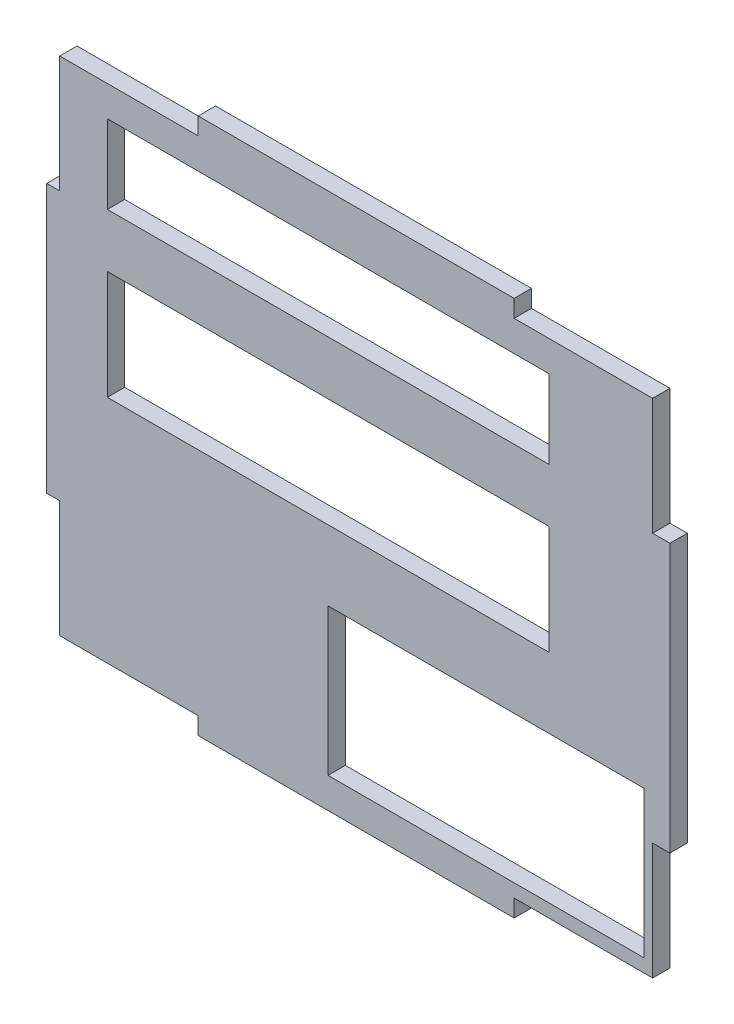
ISO-10303-21;
HEADER;
FILE_DESCRIPTION(('STEP AP214'),'2;1');
FILE_NAME('part.step','',(''),(''),'','','');
FILE_SCHEMA(('AUTOMOTIVE_DESIGN { 1 0 10303 214 1 1 1 1 }'));
ENDSEC;
DATA;
#1=APPLICATION_CONTEXT('core data for automotive mechanical design processes');
#2=APPLICATION_PROTOCOL_DEFINITION('international standard','automotive_design',2000,#1);
#3=PRODUCT_CONTEXT('',#1,'mechanical');
#4=PRODUCT('Part','Part','',(#3));
#5=PRODUCT_RELATED_PRODUCT_CATEGORY('part','',(#4));
#6=PRODUCT_DEFINITION_FORMATION('','',#4);
#7=PRODUCT_DEFINITION_CONTEXT('part definition',#1,'design');
#8=PRODUCT_DEFINITION('design','',#6,#7);
#9=PRODUCT_DEFINITION_SHAPE('','',#8);
#10=(LENGTH_UNIT() NAMED_UNIT(*) SI_UNIT(.MILLI.,.METRE.));
#11=(NAMED_UNIT(*) PLANE_ANGLE_UNIT() SI_UNIT($,.RADIAN.));
#12=(NAMED_UNIT(*) SI_UNIT($,.STERADIAN.) SOLID_ANGLE_UNIT());
#13=UNCERTAINTY_MEASURE_WITH_UNIT(LENGTH_MEASURE(1.E-05),#10,'distance_accuracy_value','');
#14=(GEOMETRIC_REPRESENTATION_CONTEXT(3) GLOBAL_UNCERTAINTY_ASSIGNED_CONTEXT((#13)) GLOBAL_UNIT_ASSIGNED_CONTEXT((#10,
#11,#12)) REPRESENTATION_CONTEXT('',''));
#15=CARTESIAN_POINT('',(0.,0.,0.));
#16=DIRECTION('',(0.,0.,1.));
#17=DIRECTION('',(1.,0.,0.));
#18=AXIS2_PLACEMENT_3D('',#15,#16,#17);
#19=CARTESIAN_POINT('',(-37.0426412226631,40.7362637362637,2.));
#20=DIRECTION('',(1.,0.,0.));
#21=DIRECTION('',(0.,0.,-1.));
#22=AXIS2_PLACEMENT_3D('',#19,#20,#21);
#23=PLANE('',#22);
#24=DIRECTION('',(0.,-1.,0.));
#25=VECTOR('',#24,1.);
#26=CARTESIAN_POINT('',(-37.0426412226631,40.7362637362637,2.));
#27=LINE('',#26,#25);
#28=CARTESIAN_POINT('',(-37.0426412226631,25.2362637362637,2.));
#29=VERTEX_POINT('',#28);
#30=CARTESIAN_POINT('',(-37.0426412226631,-5.76373626373626,2.));
#31=VERTEX_POINT('',#30);
#32=EDGE_CURVE('E463',#29,#31,#27,.T.);
#33=ORIENTED_EDGE('',*,*,#32,.F.);
#34=DIRECTION('',(0.,0.,-1.));
#35=VECTOR('',#34,1.);
#36=CARTESIAN_POINT('',(-37.0426412226631,25.2362637362637,2.));
#37=LINE('',#36,#35);
#38=CARTESIAN_POINT('',(-37.0426412226631,25.2362637362637,0.));
#39=VERTEX_POINT('',#38);
#40=EDGE_CURVE('E401',#29,#39,#37,.T.);
#41=ORIENTED_EDGE('',*,*,#40,.T.);
#42=DIRECTION('',(0.,-1.,0.));
#43=VECTOR('',#42,1.);
#44=CARTESIAN_POINT('',(-37.0426412226631,40.7362637362637,0.));
#45=LINE('',#44,#43);
#46=CARTESIAN_POINT('',(-37.0426412226631,-5.76373626373626,0.));
#47=VERTEX_POINT('',#46);
#48=EDGE_CURVE('E461',#39,#47,#45,.T.);
#49=ORIENTED_EDGE('',*,*,#48,.T.);
#50=DIRECTION('',(0.,0.,1.));
#51=VECTOR('',#50,1.);
#52=CARTESIAN_POINT('',(-37.0426412226631,-5.76373626373625,2.));
#53=LINE('',#52,#51);
#54=EDGE_CURVE('E396',#47,#31,#53,.T.);
#55=ORIENTED_EDGE('',*,*,#54,.T.);
#56=EDGE_LOOP('',(#33,#41,#49,#55));
#57=FACE_BOUND('',#56,.T.);
#58=ADVANCED_FACE('F33',(#57),#23,.F.);
#59=CARTESIAN_POINT('',(-37.0426412226631,-21.2637362637363,2.));
#60=DIRECTION('',(0.,1.,0.));
#61=DIRECTION('',(0.,0.,1.));
#62=AXIS2_PLACEMENT_3D('',#59,#60,#61);
#63=PLANE('',#62);
#64=DIRECTION('',(0.,0.,1.));
#65=VECTOR('',#64,1.);
#66=CARTESIAN_POINT('',(16.9573587773368,-21.2637362637363,0.));
#67=LINE('',#66,#65);
#68=CARTESIAN_POINT('',(16.9573587773368,-21.2637362637363,0.));
#69=VERTEX_POINT('',#68);
#70=CARTESIAN_POINT('',(16.9573587773368,-21.2637362637363,2.));
#71=VERTEX_POINT('',#70);
#72=EDGE_CURVE('E404',#69,#71,#67,.T.);
#73=ORIENTED_EDGE('',*,*,#72,.T.);
#74=DIRECTION('',(1.,0.,0.));
#75=VECTOR('',#74,1.);
#76=CARTESIAN_POINT('',(-37.0426412226631,-21.2637362637363,2.));
#77=LINE('',#76,#75);
#78=CARTESIAN_POINT('',(-19.5426412226631,-21.2637362637363,2.));
#79=VERTEX_POINT('',#78);
#80=EDGE_CURVE('E466',#79,#71,#77,.T.);
#81=ORIENTED_EDGE('',*,*,#80,.F.);
#82=DIRECTION('',(0.,0.,1.));
#83=VECTOR('',#82,1.);
#84=CARTESIAN_POINT('',(-19.5426412226631,-21.2637362637363,0.));
#85=LINE('',#84,#83);
#86=CARTESIAN_POINT('',(-19.5426412226631,-21.2637362637363,0.));
#87=VERTEX_POINT('',#86);
#88=EDGE_CURVE('E424',#87,#79,#85,.T.);
#89=ORIENTED_EDGE('',*,*,#88,.F.);
#90=DIRECTION('',(1.,0.,0.));
#91=VECTOR('',#90,1.);
#92=CARTESIAN_POINT('',(-37.0426412226631,-21.2637362637363,0.));
#93=LINE('',#92,#91);
#94=EDGE_CURVE('E479',#87,#69,#93,.T.);
#95=ORIENTED_EDGE('',*,*,#94,.T.);
#96=EDGE_LOOP('',(#73,#81,#89,#95));
#97=FACE_BOUND('',#96,.T.);
#98=ADVANCED_FACE('F541',(#97),#63,.F.);
#99=CARTESIAN_POINT('',(34.9573587773368,40.7362637362637,2.));
#100=DIRECTION('',(-1.,0.,0.));
#101=DIRECTION('',(0.,0.,1.));
#102=AXIS2_PLACEMENT_3D('',#99,#100,#101);
#103=PLANE('',#102);
#104=DIRECTION('',(0.,1.,0.));
#105=VECTOR('',#104,1.);
#106=CARTESIAN_POINT('',(34.9573587773368,40.7362637362637,2.));
#107=LINE('',#106,#105);
#108=CARTESIAN_POINT('',(34.9573587773369,-5.76373626373625,2.));
#109=VERTEX_POINT('',#108);
#110=CARTESIAN_POINT('',(34.9573587773369,25.2362637362637,2.));
#111=VERTEX_POINT('',#110);
#112=EDGE_CURVE('E470',#109,#111,#107,.T.);
#113=ORIENTED_EDGE('',*,*,#112,.F.);
#114=DIRECTION('',(0.,0.,1.));
#115=VECTOR('',#114,1.);
#116=CARTESIAN_POINT('',(34.9573587773369,-5.76373626373625,0.));
#117=LINE('',#116,#115);
#118=CARTESIAN_POINT('',(34.9573587773369,-5.76373626373625,0.));
#119=VERTEX_POINT('',#118);
#120=EDGE_CURVE('E349',#119,#109,#117,.T.);
#121=ORIENTED_EDGE('',*,*,#120,.F.);
#122=DIRECTION('',(0.,1.,0.));
#123=VECTOR('',#122,1.);
#124=CARTESIAN_POINT('',(34.9573587773368,40.7362637362637,0.));
#125=LINE('',#124,#123);
#126=CARTESIAN_POINT('',(34.9573587773369,25.2362637362637,0.));
#127=VERTEX_POINT('',#126);
#128=EDGE_CURVE('E482',#119,#127,#125,.T.);
#129=ORIENTED_EDGE('',*,*,#128,.T.);
#130=DIRECTION('',(0.,0.,1.));
#131=VECTOR('',#130,1.);
#132=CARTESIAN_POINT('',(34.9573587773369,25.2362637362637,0.));
#133=LINE('',#132,#131);
#134=EDGE_CURVE('E393',#127,#111,#133,.T.);
#135=ORIENTED_EDGE('',*,*,#134,.T.);
#136=EDGE_LOOP('',(#113,#121,#129,#135));
#137=FACE_BOUND('',#136,.T.);
#138=ADVANCED_FACE('F562',(#137),#103,.F.);
#139=CARTESIAN_POINT('',(-37.0426412226631,40.7362637362637,2.));
#140=DIRECTION('',(0.,-1.,0.));
#141=DIRECTION('',(0.,0.,-1.));
#142=AXIS2_PLACEMENT_3D('',#139,#140,#141);
#143=PLANE('',#142);
#144=DIRECTION('',(0.,0.,1.));
#145=VECTOR('',#144,1.);
#146=CARTESIAN_POINT('',(-19.5426412226631,40.7362637362637,0.));
#147=LINE('',#146,#145);
#148=CARTESIAN_POINT('',(-19.5426412226631,40.7362637362637,0.));
#149=VERTEX_POINT('',#148);
#150=CARTESIAN_POINT('',(-19.5426412226631,40.7362637362637,2.));
#151=VERTEX_POINT('',#150);
#152=EDGE_CURVE('E409',#149,#151,#147,.T.);
#153=ORIENTED_EDGE('',*,*,#152,.T.);
#154=DIRECTION('',(-1.,0.,0.));
#155=VECTOR('',#154,1.);
#156=CARTESIAN_POINT('',(-37.0426412226631,40.7362637362637,2.));
#157=LINE('',#156,#155);
#158=CARTESIAN_POINT('',(16.9573587773368,40.7362637362637,2.));
#159=VERTEX_POINT('',#158);
#160=EDGE_CURVE('E473',#159,#151,#157,.T.);
#161=ORIENTED_EDGE('',*,*,#160,.F.);
#162=DIRECTION('',(0.,0.,1.));
#163=VECTOR('',#162,1.);
#164=CARTESIAN_POINT('',(16.9573587773368,40.7362637362637,0.));
#165=LINE('',#164,#163);
#166=CARTESIAN_POINT('',(16.9573587773368,40.7362637362637,0.));
#167=VERTEX_POINT('',#166);
#168=EDGE_CURVE('E454',#167,#159,#165,.T.);
#169=ORIENTED_EDGE('',*,*,#168,.F.);
#170=DIRECTION('',(-1.,0.,0.));
#171=VECTOR('',#170,1.);
#172=CARTESIAN_POINT('',(-37.0426412226631,40.7362637362637,0.));
#173=LINE('',#172,#171);
#174=EDGE_CURVE('E467',#167,#149,#173,.T.);
#175=ORIENTED_EDGE('',*,*,#174,.T.);
#176=EDGE_LOOP('',(#153,#161,#169,#175));
#177=FACE_BOUND('',#176,.T.);
#178=ADVANCED_FACE('F512',(#177),#143,.F.);
#179=CARTESIAN_POINT('',(0.,0.,2.));
#180=DIRECTION('',(0.,0.,1.));
#181=DIRECTION('',(1.,0.,0.));
#182=AXIS2_PLACEMENT_3D('',#179,#180,#181);
#183=PLANE('',#182);
#184=DIRECTION('',(0.,1.,0.));
#185=VECTOR('',#184,1.);
#186=CARTESIAN_POINT('',(31.9573587773367,-17.7397362637363,2.));
#187=LINE('',#186,#185);
#188=CARTESIAN_POINT('',(31.9573587773367,-17.7397362637363,2.));
#189=VERTEX_POINT('',#188);
#190=CARTESIAN_POINT('',(31.9573587773367,-0.784191440651759,2.));
#191=VERTEX_POINT('',#190);
#192=EDGE_CURVE('E47',#189,#191,#187,.T.);
#193=ORIENTED_EDGE('',*,*,#192,.F.);
#194=DIRECTION('',(1.,0.,0.));
#195=VECTOR('',#194,1.);
#196=CARTESIAN_POINT('',(31.9573587773367,-17.7397362637363,2.));
#197=LINE('',#196,#195);
#198=CARTESIAN_POINT('',(-4.54264122266389,-17.7397362637363,2.));
#199=VERTEX_POINT('',#198);
#200=EDGE_CURVE('E261',#199,#189,#197,.T.);
#201=ORIENTED_EDGE('',*,*,#200,.F.);
#202=DIRECTION('',(0.,-1.,0.));
#203=VECTOR('',#202,1.);
#204=CARTESIAN_POINT('',(-4.54264122266389,-17.7397362637363,2.));
#205=LINE('',#204,#203);
#206=CARTESIAN_POINT('',(-4.54264122266389,-0.784191440651759,2.));
#207=VERTEX_POINT('',#206);
#208=EDGE_CURVE('E264',#207,#199,#205,.T.);
#209=ORIENTED_EDGE('',*,*,#208,.F.);
#210=DIRECTION('',(-1.,0.,0.));
#211=VECTOR('',#210,1.);
#212=CARTESIAN_POINT('',(31.9573587773367,-0.784191440651759,2.));
#213=LINE('',#212,#211);
#214=EDGE_CURVE('E270',#191,#207,#213,.T.);
#215=ORIENTED_EDGE('',*,*,#214,.F.);
#216=EDGE_LOOP('',(#193,#201,#209,#215));
#217=FACE_BOUND('',#216,.T.);
#218=DIRECTION('',(0.,1.,0.));
#219=VECTOR('',#218,1.);
#220=CARTESIAN_POINT('',(20.9573587773368,7.33626373626373,2.));
#221=LINE('',#220,#219);
#222=CARTESIAN_POINT('',(20.9573587773368,7.33626373626373,2.));
#223=VERTEX_POINT('',#222);
#224=CARTESIAN_POINT('',(20.9573587773368,19.9326434154229,2.));
#225=VERTEX_POINT('',#224);
#226=EDGE_CURVE('E55',#223,#225,#221,.T.);
#227=ORIENTED_EDGE('',*,*,#226,.F.);
#228=DIRECTION('',(1.,0.,0.));
#229=VECTOR('',#228,1.);
#230=CARTESIAN_POINT('',(20.9573587773368,7.33626373626373,2.));
#231=LINE('',#230,#229);
#232=CARTESIAN_POINT('',(-30.0426412226624,7.33626373626373,2.));
#233=VERTEX_POINT('',#232);
#234=EDGE_CURVE('E285',#233,#223,#231,.T.);
#235=ORIENTED_EDGE('',*,*,#234,.F.);
#236=DIRECTION('',(0.,-1.,0.));
#237=VECTOR('',#236,1.);
#238=CARTESIAN_POINT('',(-30.0426412226624,7.33626373626373,2.));
#239=LINE('',#238,#237);
#240=CARTESIAN_POINT('',(-30.0426412226624,19.9326434154229,2.));
#241=VERTEX_POINT('',#240);
#242=EDGE_CURVE('E300',#241,#233,#239,.T.);
#243=ORIENTED_EDGE('',*,*,#242,.F.);
#244=DIRECTION('',(-1.,0.,0.));
#245=VECTOR('',#244,1.);
#246=CARTESIAN_POINT('',(20.9573587773368,19.9326434154229,2.));
#247=LINE('',#246,#245);
#248=EDGE_CURVE('E296',#225,#241,#247,.T.);
#249=ORIENTED_EDGE('',*,*,#248,.F.);
#250=EDGE_LOOP('',(#227,#235,#243,#249));
#251=FACE_BOUND('',#250,.T.);
#252=DIRECTION('',(0.,1.,0.));
#253=VECTOR('',#252,1.);
#254=CARTESIAN_POINT('',(20.9573587773369,26.1362637362637,2.));
#255=LINE('',#254,#253);
#256=CARTESIAN_POINT('',(20.9573587773369,26.1362637362637,2.));
#257=VERTEX_POINT('',#256);
#258=CARTESIAN_POINT('',(20.9573587773369,35.2113091217779,2.));
#259=VERTEX_POINT('',#258);
#260=EDGE_CURVE('E325',#257,#259,#255,.T.);
#261=ORIENTED_EDGE('',*,*,#260,.F.);
#262=DIRECTION('',(1.,0.,0.));
#263=VECTOR('',#262,1.);
#264=CARTESIAN_POINT('',(20.9573587773369,26.1362637362637,2.));
#265=LINE('',#264,#263);
#266=CARTESIAN_POINT('',(-30.0426412226624,26.1362637362637,2.));
#267=VERTEX_POINT('',#266);
#268=EDGE_CURVE('E315',#267,#257,#265,.T.);
#269=ORIENTED_EDGE('',*,*,#268,.F.);
#270=DIRECTION('',(0.,-1.,0.));
#271=VECTOR('',#270,1.);
#272=CARTESIAN_POINT('',(-30.0426412226624,26.1362637362637,2.));
#273=LINE('',#272,#271);
#274=CARTESIAN_POINT('',(-30.0426412226624,35.2113091217779,2.));
#275=VERTEX_POINT('',#274);
#276=EDGE_CURVE('E330',#275,#267,#273,.T.);
#277=ORIENTED_EDGE('',*,*,#276,.F.);
#278=DIRECTION('',(-1.,0.,0.));
#279=VECTOR('',#278,1.);
#280=CARTESIAN_POINT('',(20.9573587773369,35.2113091217779,2.));
#281=LINE('',#280,#279);
#282=EDGE_CURVE('E327',#259,#275,#281,.T.);
#283=ORIENTED_EDGE('',*,*,#282,.F.);
#284=EDGE_LOOP('',(#261,#269,#277,#283));
#285=FACE_BOUND('',#284,.T.);
#286=DIRECTION('',(0.,1.,0.));
#287=VECTOR('',#286,1.);
#288=CARTESIAN_POINT('',(-35.5426412226631,40.7362637362637,2.));
#289=LINE('',#288,#287);
#290=CARTESIAN_POINT('',(-35.5426412226631,25.2362637362637,2.));
#291=VERTEX_POINT('',#290);
#292=CARTESIAN_POINT('',(-35.5426412226631,38.7362637362637,2.));
#293=VERTEX_POINT('',#292);
#294=EDGE_CURVE('E376',#291,#293,#289,.T.);
#295=ORIENTED_EDGE('',*,*,#294,.F.);
#296=DIRECTION('',(1.,0.,0.));
#297=VECTOR('',#296,1.);
#298=CARTESIAN_POINT('',(-37.5426412226631,25.2362637362637,2.));
#299=LINE('',#298,#297);
#300=EDGE_CURVE('E277',#29,#291,#299,.T.);
#301=ORIENTED_EDGE('',*,*,#300,.F.);
#302=ORIENTED_EDGE('',*,*,#32,.T.);
#303=DIRECTION('',(-1.,0.,0.));
#304=VECTOR('',#303,1.);
#305=CARTESIAN_POINT('',(-37.5426412226631,-5.76373626373626,2.));
#306=LINE('',#305,#304);
#307=CARTESIAN_POINT('',(-35.5426412226631,-5.76373626373626,2.));
#308=VERTEX_POINT('',#307);
#309=EDGE_CURVE('E363',#308,#31,#306,.T.);
#310=ORIENTED_EDGE('',*,*,#309,.F.);
#311=DIRECTION('',(0.,1.,0.));
#312=VECTOR('',#311,1.);
#313=CARTESIAN_POINT('',(-35.5426412226631,-21.2637362637363,2.));
#314=LINE('',#313,#312);
#315=CARTESIAN_POINT('',(-35.5426412226631,-19.2637362637363,2.));
#316=VERTEX_POINT('',#315);
#317=EDGE_CURVE('E366',#316,#308,#314,.T.);
#318=ORIENTED_EDGE('',*,*,#317,.F.);
#319=DIRECTION('',(1.,0.,0.));
#320=VECTOR('',#319,1.);
#321=CARTESIAN_POINT('',(-37.5426412226631,-19.2637362637363,2.));
#322=LINE('',#321,#320);
#323=CARTESIAN_POINT('',(-19.5426412226631,-19.2637362637363,2.));
#324=VERTEX_POINT('',#323);
#325=EDGE_CURVE('E412',#316,#324,#322,.T.);
#326=ORIENTED_EDGE('',*,*,#325,.T.);
#327=DIRECTION('',(0.,1.,0.));
#328=VECTOR('',#327,1.);
#329=CARTESIAN_POINT('',(-19.5426412226631,-21.2637362637363,2.));
#330=LINE('',#329,#328);
#331=EDGE_CURVE('E428',#79,#324,#330,.T.);
#332=ORIENTED_EDGE('',*,*,#331,.F.);
#333=ORIENTED_EDGE('',*,*,#80,.T.);
#334=DIRECTION('',(0.,1.,0.));
#335=VECTOR('',#334,1.);
#336=CARTESIAN_POINT('',(16.9573587773368,-21.2637362637363,2.));
#337=LINE('',#336,#335);
#338=CARTESIAN_POINT('',(16.9573587773368,-19.2637362637363,2.));
#339=VERTEX_POINT('',#338);
#340=EDGE_CURVE('E440',#71,#339,#337,.T.);
#341=ORIENTED_EDGE('',*,*,#340,.T.);
#342=DIRECTION('',(-1.,0.,0.));
#343=VECTOR('',#342,1.);
#344=CARTESIAN_POINT('',(34.9573587773368,-19.2637362637363,2.));
#345=LINE('',#344,#343);
#346=CARTESIAN_POINT('',(32.9573587773369,-19.2637362637363,2.));
#347=VERTEX_POINT('',#346);
#348=EDGE_CURVE('E425',#347,#339,#345,.T.);
#349=ORIENTED_EDGE('',*,*,#348,.F.);
#350=DIRECTION('',(0.,-1.,0.));
#351=VECTOR('',#350,1.);
#352=CARTESIAN_POINT('',(32.9573587773369,-21.2637362637363,2.));
#353=LINE('',#352,#351);
#354=CARTESIAN_POINT('',(32.9573587773369,-5.76373626373625,2.));
#355=VERTEX_POINT('',#354);
#356=EDGE_CURVE('E346',#355,#347,#353,.T.);
#357=ORIENTED_EDGE('',*,*,#356,.F.);
#358=DIRECTION('',(-1.,0.,0.));
#359=VECTOR('',#358,1.);
#360=CARTESIAN_POINT('',(34.9573587773369,-5.76373626373625,2.));
#361=LINE('',#360,#359);
#362=EDGE_CURVE('E350',#109,#355,#361,.T.);
#363=ORIENTED_EDGE('',*,*,#362,.F.);
#364=ORIENTED_EDGE('',*,*,#112,.T.);
#365=DIRECTION('',(1.,0.,0.));
#366=VECTOR('',#365,1.);
#367=CARTESIAN_POINT('',(34.9573587773369,25.2362637362637,2.));
#368=LINE('',#367,#366);
#369=CARTESIAN_POINT('',(32.9573587773369,25.2362637362637,2.));
#370=VERTEX_POINT('',#369);
#371=EDGE_CURVE('E387',#370,#111,#368,.T.);
#372=ORIENTED_EDGE('',*,*,#371,.F.);
#373=DIRECTION('',(0.,-1.,0.));
#374=VECTOR('',#373,1.);
#375=CARTESIAN_POINT('',(32.9573587773369,40.7362637362637,2.));
#376=LINE('',#375,#374);
#377=CARTESIAN_POINT('',(32.9573587773369,38.7362637362637,2.));
#378=VERTEX_POINT('',#377);
#379=EDGE_CURVE('E357',#378,#370,#376,.T.);
#380=ORIENTED_EDGE('',*,*,#379,.F.);
#381=DIRECTION('',(-1.,0.,0.));
#382=VECTOR('',#381,1.);
#383=CARTESIAN_POINT('',(34.9573587773368,38.7362637362637,2.));
#384=LINE('',#383,#382);
#385=CARTESIAN_POINT('',(16.9573587773368,38.7362637362637,2.));
#386=VERTEX_POINT('',#385);
#387=EDGE_CURVE('E452',#378,#386,#384,.T.);
#388=ORIENTED_EDGE('',*,*,#387,.T.);
#389=DIRECTION('',(0.,-1.,0.));
#390=VECTOR('',#389,1.);
#391=CARTESIAN_POINT('',(16.9573587773368,40.7362637362637,2.));
#392=LINE('',#391,#390);
#393=EDGE_CURVE('E418',#159,#386,#392,.T.);
#394=ORIENTED_EDGE('',*,*,#393,.F.);
#395=ORIENTED_EDGE('',*,*,#160,.T.);
#396=DIRECTION('',(0.,-1.,0.));
#397=VECTOR('',#396,1.);
#398=CARTESIAN_POINT('',(-19.5426412226631,40.7362637362637,2.));
#399=LINE('',#398,#397);
#400=CARTESIAN_POINT('',(-19.5426412226631,38.7362637362637,2.));
#401=VERTEX_POINT('',#400);
#402=EDGE_CURVE('E413',#151,#401,#399,.T.);
#403=ORIENTED_EDGE('',*,*,#402,.T.);
#404=DIRECTION('',(1.,0.,0.));
#405=VECTOR('',#404,1.);
#406=CARTESIAN_POINT('',(-37.5426412226631,38.7362637362637,2.));
#407=LINE('',#406,#405);
#408=EDGE_CURVE('E416',#293,#401,#407,.T.);
#409=ORIENTED_EDGE('',*,*,#408,.F.);
#410=EDGE_LOOP('',(#295,#301,#302,#310,#318,#326,#332,#333,#341,#349,#357,#363,#364,#372,#380,
#388,#394,#395,#403,#409));
#411=FACE_BOUND('',#410,.T.);
#412=ADVANCED_FACE('F504',(#217,#251,#285,#411),#183,.T.);
#413=CARTESIAN_POINT('',(0.,0.,0.));
#414=DIRECTION('',(0.,0.,1.));
#415=DIRECTION('',(1.,0.,0.));
#416=AXIS2_PLACEMENT_3D('',#413,#414,#415);
#417=PLANE('',#416);
#418=DIRECTION('',(1.,0.,0.));
#419=VECTOR('',#418,1.);
#420=CARTESIAN_POINT('',(31.9573587773367,-17.7397362637363,0.));
#421=LINE('',#420,#419);
#422=CARTESIAN_POINT('',(-4.54264122266389,-17.7397362637363,0.));
#423=VERTEX_POINT('',#422);
#424=CARTESIAN_POINT('',(31.9573587773367,-17.7397362637363,0.));
#425=VERTEX_POINT('',#424);
#426=EDGE_CURVE('E248',#423,#425,#421,.T.);
#427=ORIENTED_EDGE('',*,*,#426,.T.);
#428=DIRECTION('',(0.,1.,0.));
#429=VECTOR('',#428,1.);
#430=CARTESIAN_POINT('',(31.9573587773367,-17.7397362637363,0.));
#431=LINE('',#430,#429);
#432=CARTESIAN_POINT('',(31.9573587773367,-0.784191440651759,0.));
#433=VERTEX_POINT('',#432);
#434=EDGE_CURVE('E242',#425,#433,#431,.T.);
#435=ORIENTED_EDGE('',*,*,#434,.T.);
#436=DIRECTION('',(-1.,0.,0.));
#437=VECTOR('',#436,1.);
#438=CARTESIAN_POINT('',(31.9573587773367,-0.784191440651759,0.));
#439=LINE('',#438,#437);
#440=CARTESIAN_POINT('',(-4.54264122266389,-0.784191440651759,0.));
#441=VERTEX_POINT('',#440);
#442=EDGE_CURVE('E252',#433,#441,#439,.T.);
#443=ORIENTED_EDGE('',*,*,#442,.T.);
#444=DIRECTION('',(0.,-1.,0.));
#445=VECTOR('',#444,1.);
#446=CARTESIAN_POINT('',(-4.54264122266389,-17.7397362637363,0.));
#447=LINE('',#446,#445);
#448=EDGE_CURVE('E256',#441,#423,#447,.T.);
#449=ORIENTED_EDGE('',*,*,#448,.T.);
#450=EDGE_LOOP('',(#427,#435,#443,#449));
#451=FACE_BOUND('',#450,.T.);
#452=DIRECTION('',(1.,0.,0.));
#453=VECTOR('',#452,1.);
#454=CARTESIAN_POINT('',(20.9573587773368,7.33626373626373,0.));
#455=LINE('',#454,#453);
#456=CARTESIAN_POINT('',(-30.0426412226624,7.33626373626373,0.));
#457=VERTEX_POINT('',#456);
#458=CARTESIAN_POINT('',(20.9573587773368,7.33626373626373,0.));
#459=VERTEX_POINT('',#458);
#460=EDGE_CURVE('E291',#457,#459,#455,.T.);
#461=ORIENTED_EDGE('',*,*,#460,.T.);
#462=DIRECTION('',(0.,1.,0.));
#463=VECTOR('',#462,1.);
#464=CARTESIAN_POINT('',(20.9573587773368,7.33626373626373,0.));
#465=LINE('',#464,#463);
#466=CARTESIAN_POINT('',(20.9573587773368,19.9326434154229,0.));
#467=VERTEX_POINT('',#466);
#468=EDGE_CURVE('E281',#459,#467,#465,.T.);
#469=ORIENTED_EDGE('',*,*,#468,.T.);
#470=DIRECTION('',(-1.,0.,0.));
#471=VECTOR('',#470,1.);
#472=CARTESIAN_POINT('',(20.9573587773368,19.9326434154229,0.));
#473=LINE('',#472,#471);
#474=CARTESIAN_POINT('',(-30.0426412226624,19.9326434154229,0.));
#475=VERTEX_POINT('',#474);
#476=EDGE_CURVE('E284',#467,#475,#473,.T.);
#477=ORIENTED_EDGE('',*,*,#476,.T.);
#478=DIRECTION('',(0.,-1.,0.));
#479=VECTOR('',#478,1.);
#480=CARTESIAN_POINT('',(-30.0426412226624,7.33626373626373,0.));
#481=LINE('',#480,#479);
#482=EDGE_CURVE('E288',#475,#457,#481,.T.);
#483=ORIENTED_EDGE('',*,*,#482,.T.);
#484=EDGE_LOOP('',(#461,#469,#477,#483));
#485=FACE_BOUND('',#484,.T.);
#486=DIRECTION('',(1.,0.,0.));
#487=VECTOR('',#486,1.);
#488=CARTESIAN_POINT('',(20.9573587773369,26.1362637362637,0.));
#489=LINE('',#488,#487);
#490=CARTESIAN_POINT('',(-30.0426412226624,26.1362637362637,0.));
#491=VERTEX_POINT('',#490);
#492=CARTESIAN_POINT('',(20.9573587773369,26.1362637362637,0.));
#493=VERTEX_POINT('',#492);
#494=EDGE_CURVE('E321',#491,#493,#489,.T.);
#495=ORIENTED_EDGE('',*,*,#494,.T.);
#496=DIRECTION('',(0.,1.,0.));
#497=VECTOR('',#496,1.);
#498=CARTESIAN_POINT('',(20.9573587773369,26.1362637362637,0.));
#499=LINE('',#498,#497);
#500=CARTESIAN_POINT('',(20.9573587773369,35.2113091217779,0.));
#501=VERTEX_POINT('',#500);
#502=EDGE_CURVE('E311',#493,#501,#499,.T.);
#503=ORIENTED_EDGE('',*,*,#502,.T.);
#504=DIRECTION('',(-1.,0.,0.));
#505=VECTOR('',#504,1.);
#506=CARTESIAN_POINT('',(20.9573587773369,35.2113091217779,0.));
#507=LINE('',#506,#505);
#508=CARTESIAN_POINT('',(-30.0426412226624,35.2113091217779,0.));
#509=VERTEX_POINT('',#508);
#510=EDGE_CURVE('E314',#501,#509,#507,.T.);
#511=ORIENTED_EDGE('',*,*,#510,.T.);
#512=DIRECTION('',(0.,-1.,0.));
#513=VECTOR('',#512,1.);
#514=CARTESIAN_POINT('',(-30.0426412226624,26.1362637362637,0.));
#515=LINE('',#514,#513);
#516=EDGE_CURVE('E318',#509,#491,#515,.T.);
#517=ORIENTED_EDGE('',*,*,#516,.T.);
#518=EDGE_LOOP('',(#495,#503,#511,#517));
#519=FACE_BOUND('',#518,.T.);
#520=DIRECTION('',(1.,0.,0.));
#521=VECTOR('',#520,1.);
#522=CARTESIAN_POINT('',(-37.5426412226631,25.2362637362637,0.));
#523=LINE('',#522,#521);
#524=CARTESIAN_POINT('',(-35.5426412226631,25.2362637362637,0.));
#525=VERTEX_POINT('',#524);
#526=EDGE_CURVE('E372',#39,#525,#523,.T.);
#527=ORIENTED_EDGE('',*,*,#526,.T.);
#528=DIRECTION('',(0.,1.,0.));
#529=VECTOR('',#528,1.);
#530=CARTESIAN_POINT('',(-35.5426412226631,40.7362637362637,0.));
#531=LINE('',#530,#529);
#532=CARTESIAN_POINT('',(-35.5426412226631,38.7362637362637,0.));
#533=VERTEX_POINT('',#532);
#534=EDGE_CURVE('E375',#525,#533,#531,.T.);
#535=ORIENTED_EDGE('',*,*,#534,.T.);
#536=DIRECTION('',(1.,0.,0.));
#537=VECTOR('',#536,1.);
#538=CARTESIAN_POINT('',(0.,38.7362637362637,0.));
#539=LINE('',#538,#537);
#540=CARTESIAN_POINT('',(-19.5426412226631,38.7362637362637,0.));
#541=VERTEX_POINT('',#540);
#542=EDGE_CURVE('E476',#533,#541,#539,.T.);
#543=ORIENTED_EDGE('',*,*,#542,.T.);
#544=DIRECTION('',(0.,-1.,0.));
#545=VECTOR('',#544,1.);
#546=CARTESIAN_POINT('',(-19.5426412226631,40.7362637362637,0.));
#547=LINE('',#546,#545);
#548=EDGE_CURVE('E408',#149,#541,#547,.T.);
#549=ORIENTED_EDGE('',*,*,#548,.F.);
#550=ORIENTED_EDGE('',*,*,#174,.F.);
#551=DIRECTION('',(0.,-1.,0.));
#552=VECTOR('',#551,1.);
#553=CARTESIAN_POINT('',(16.9573587773368,40.7362637362637,0.));
#554=LINE('',#553,#552);
#555=CARTESIAN_POINT('',(16.9573587773368,38.7362637362637,0.));
#556=VERTEX_POINT('',#555);
#557=EDGE_CURVE('E448',#167,#556,#554,.T.);
#558=ORIENTED_EDGE('',*,*,#557,.T.);
#559=DIRECTION('',(-1.,0.,0.));
#560=VECTOR('',#559,1.);
#561=CARTESIAN_POINT('',(34.9573587773368,38.7362637362637,0.));
#562=LINE('',#561,#560);
#563=CARTESIAN_POINT('',(32.9573587773369,38.7362637362637,0.));
#564=VERTEX_POINT('',#563);
#565=EDGE_CURVE('E451',#564,#556,#562,.T.);
#566=ORIENTED_EDGE('',*,*,#565,.F.);
#567=DIRECTION('',(0.,-1.,0.));
#568=VECTOR('',#567,1.);
#569=CARTESIAN_POINT('',(32.9573587773369,40.7362637362637,0.));
#570=LINE('',#569,#568);
#571=CARTESIAN_POINT('',(32.9573587773369,25.2362637362637,0.));
#572=VERTEX_POINT('',#571);
#573=EDGE_CURVE('E383',#564,#572,#570,.T.);
#574=ORIENTED_EDGE('',*,*,#573,.T.);
#575=DIRECTION('',(1.,0.,0.));
#576=VECTOR('',#575,1.);
#577=CARTESIAN_POINT('',(34.9573587773369,25.2362637362637,0.));
#578=LINE('',#577,#576);
#579=EDGE_CURVE('E386',#572,#127,#578,.T.);
#580=ORIENTED_EDGE('',*,*,#579,.T.);
#581=ORIENTED_EDGE('',*,*,#128,.F.);
#582=DIRECTION('',(-1.,0.,0.));
#583=VECTOR('',#582,1.);
#584=CARTESIAN_POINT('',(34.9573587773369,-5.76373626373625,0.));
#585=LINE('',#584,#583);
#586=CARTESIAN_POINT('',(32.9573587773369,-5.76373626373625,0.));
#587=VERTEX_POINT('',#586);
#588=EDGE_CURVE('E342',#119,#587,#585,.T.);
#589=ORIENTED_EDGE('',*,*,#588,.T.);
#590=DIRECTION('',(0.,-1.,0.));
#591=VECTOR('',#590,1.);
#592=CARTESIAN_POINT('',(32.9573587773369,-21.2637362637363,0.));
#593=LINE('',#592,#591);
#594=CARTESIAN_POINT('',(32.9573587773369,-19.2637362637363,0.));
#595=VERTEX_POINT('',#594);
#596=EDGE_CURVE('E345',#587,#595,#593,.T.);
#597=ORIENTED_EDGE('',*,*,#596,.T.);
#598=DIRECTION('',(-1.,0.,0.));
#599=VECTOR('',#598,1.);
#600=CARTESIAN_POINT('',(34.9573587773368,-19.2637362637363,0.));
#601=LINE('',#600,#599);
#602=CARTESIAN_POINT('',(16.9573587773368,-19.2637362637363,0.));
#603=VERTEX_POINT('',#602);
#604=EDGE_CURVE('E443',#595,#603,#601,.T.);
#605=ORIENTED_EDGE('',*,*,#604,.T.);
#606=DIRECTION('',(0.,1.,0.));
#607=VECTOR('',#606,1.);
#608=CARTESIAN_POINT('',(16.9573587773368,-21.2637362637363,0.));
#609=LINE('',#608,#607);
#610=EDGE_CURVE('E437',#69,#603,#609,.T.);
#611=ORIENTED_EDGE('',*,*,#610,.F.);
#612=ORIENTED_EDGE('',*,*,#94,.F.);
#613=DIRECTION('',(0.,1.,0.));
#614=VECTOR('',#613,1.);
#615=CARTESIAN_POINT('',(-19.5426412226631,-21.2637362637363,0.));
#616=LINE('',#615,#614);
#617=CARTESIAN_POINT('',(-19.5426412226631,-19.2637362637363,0.));
#618=VERTEX_POINT('',#617);
#619=EDGE_CURVE('E427',#87,#618,#616,.T.);
#620=ORIENTED_EDGE('',*,*,#619,.T.);
#621=DIRECTION('',(1.,0.,0.));
#622=VECTOR('',#621,1.);
#623=CARTESIAN_POINT('',(0.,-19.2637362637363,0.));
#624=LINE('',#623,#622);
#625=CARTESIAN_POINT('',(-35.5426412226631,-19.2637362637363,0.));
#626=VERTEX_POINT('',#625);
#627=EDGE_CURVE('E488',#626,#618,#624,.T.);
#628=ORIENTED_EDGE('',*,*,#627,.F.);
#629=DIRECTION('',(0.,1.,0.));
#630=VECTOR('',#629,1.);
#631=CARTESIAN_POINT('',(-35.5426412226631,-21.2637362637363,0.));
#632=LINE('',#631,#630);
#633=CARTESIAN_POINT('',(-35.5426412226631,-5.76373626373626,0.));
#634=VERTEX_POINT('',#633);
#635=EDGE_CURVE('E359',#626,#634,#632,.T.);
#636=ORIENTED_EDGE('',*,*,#635,.T.);
#637=DIRECTION('',(-1.,0.,0.));
#638=VECTOR('',#637,1.);
#639=CARTESIAN_POINT('',(-37.5426412226631,-5.76373626373626,0.));
#640=LINE('',#639,#638);
#641=EDGE_CURVE('E362',#634,#47,#640,.T.);
#642=ORIENTED_EDGE('',*,*,#641,.T.);
#643=ORIENTED_EDGE('',*,*,#48,.F.);
#644=EDGE_LOOP('',(#527,#535,#543,#549,#550,#558,#566,#574,#580,#581,#589,#597,#605,#611,#612,
#620,#628,#636,#642,#643));
#645=FACE_BOUND('',#644,.T.);
#646=ADVANCED_FACE('F258',(#451,#485,#519,#645),#417,.F.);
#647=CARTESIAN_POINT('',(34.9573587773368,38.7362637362637,0.));
#648=DIRECTION('',(0.,1.,0.));
#649=DIRECTION('',(0.,0.,1.));
#650=AXIS2_PLACEMENT_3D('',#647,#648,#649);
#651=PLANE('',#650);
#652=DIRECTION('',(0.,0.,1.));
#653=VECTOR('',#652,1.);
#654=CARTESIAN_POINT('',(32.9573587773369,38.7362637362637,0.));
#655=LINE('',#654,#653);
#656=EDGE_CURVE('E11',#564,#378,#655,.T.);
#657=ORIENTED_EDGE('',*,*,#656,.F.);
#658=ORIENTED_EDGE('',*,*,#565,.T.);
#659=DIRECTION('',(0.,0.,1.));
#660=VECTOR('',#659,1.);
#661=CARTESIAN_POINT('',(16.9573587773368,38.7362637362637,0.));
#662=LINE('',#661,#660);
#663=EDGE_CURVE('E458',#556,#386,#662,.T.);
#664=ORIENTED_EDGE('',*,*,#663,.T.);
#665=ORIENTED_EDGE('',*,*,#387,.F.);
#666=EDGE_LOOP('',(#657,#658,#664,#665));
#667=FACE_BOUND('',#666,.T.);
#668=ADVANCED_FACE('F572',(#667),#651,.T.);
#669=CARTESIAN_POINT('',(16.9573587773368,40.7362637362637,0.));
#670=DIRECTION('',(-1.,0.,0.));
#671=DIRECTION('',(0.,0.,1.));
#672=AXIS2_PLACEMENT_3D('',#669,#670,#671);
#673=PLANE('',#672);
#674=ORIENTED_EDGE('',*,*,#393,.T.);
#675=ORIENTED_EDGE('',*,*,#663,.F.);
#676=ORIENTED_EDGE('',*,*,#557,.F.);
#677=ORIENTED_EDGE('',*,*,#168,.T.);
#678=EDGE_LOOP('',(#674,#675,#676,#677));
#679=FACE_BOUND('',#678,.T.);
#680=ADVANCED_FACE('F575',(#679),#673,.F.);
#681=CARTESIAN_POINT('',(-37.5426412226631,38.7362637362637,0.));
#682=DIRECTION('',(0.,-1.,0.));
#683=DIRECTION('',(0.,0.,-1.));
#684=AXIS2_PLACEMENT_3D('',#681,#682,#683);
#685=PLANE('',#684);
#686=ORIENTED_EDGE('',*,*,#542,.F.);
#687=DIRECTION('',(0.,0.,1.));
#688=VECTOR('',#687,1.);
#689=CARTESIAN_POINT('',(-35.5426412226631,38.7362637362637,0.));
#690=LINE('',#689,#688);
#691=EDGE_CURVE('E40',#533,#293,#690,.T.);
#692=ORIENTED_EDGE('',*,*,#691,.T.);
#693=ORIENTED_EDGE('',*,*,#408,.T.);
#694=DIRECTION('',(0.,0.,1.));
#695=VECTOR('',#694,1.);
#696=CARTESIAN_POINT('',(-19.5426412226631,38.7362637362637,0.));
#697=LINE('',#696,#695);
#698=EDGE_CURVE('E405',#541,#401,#697,.T.);
#699=ORIENTED_EDGE('',*,*,#698,.F.);
#700=EDGE_LOOP('',(#686,#692,#693,#699));
#701=FACE_BOUND('',#700,.T.);
#702=ADVANCED_FACE('F498',(#701),#685,.F.);
#703=CARTESIAN_POINT('',(-19.5426412226631,40.7362637362637,0.));
#704=DIRECTION('',(-1.,0.,0.));
#705=DIRECTION('',(0.,0.,1.));
#706=AXIS2_PLACEMENT_3D('',#703,#704,#705);
#707=PLANE('',#706);
#708=ORIENTED_EDGE('',*,*,#402,.F.);
#709=ORIENTED_EDGE('',*,*,#152,.F.);
#710=ORIENTED_EDGE('',*,*,#548,.T.);
#711=ORIENTED_EDGE('',*,*,#698,.T.);
#712=EDGE_LOOP('',(#708,#709,#710,#711));
#713=FACE_BOUND('',#712,.T.);
#714=ADVANCED_FACE('F509',(#713),#707,.T.);
#715=CARTESIAN_POINT('',(-37.5426412226631,-19.2637362637363,0.));
#716=DIRECTION('',(0.,-1.,0.));
#717=DIRECTION('',(0.,0.,-1.));
#718=AXIS2_PLACEMENT_3D('',#715,#716,#717);
#719=PLANE('',#718);
#720=DIRECTION('',(0.,0.,1.));
#721=VECTOR('',#720,1.);
#722=CARTESIAN_POINT('',(-35.5426412226631,-19.2637362637363,0.));
#723=LINE('',#722,#721);
#724=EDGE_CURVE('E493',#626,#316,#723,.T.);
#725=ORIENTED_EDGE('',*,*,#724,.F.);
#726=ORIENTED_EDGE('',*,*,#627,.T.);
#727=DIRECTION('',(0.,0.,1.));
#728=VECTOR('',#727,1.);
#729=CARTESIAN_POINT('',(-19.5426412226631,-19.2637362637363,0.));
#730=LINE('',#729,#728);
#731=EDGE_CURVE('E421',#618,#324,#730,.T.);
#732=ORIENTED_EDGE('',*,*,#731,.T.);
#733=ORIENTED_EDGE('',*,*,#325,.F.);
#734=EDGE_LOOP('',(#725,#726,#732,#733));
#735=FACE_BOUND('',#734,.T.);
#736=ADVANCED_FACE('F534',(#735),#719,.T.);
#737=CARTESIAN_POINT('',(-19.5426412226631,-21.2637362637363,0.));
#738=DIRECTION('',(1.,0.,0.));
#739=DIRECTION('',(0.,0.,-1.));
#740=AXIS2_PLACEMENT_3D('',#737,#738,#739);
#741=PLANE('',#740);
#742=ORIENTED_EDGE('',*,*,#331,.T.);
#743=ORIENTED_EDGE('',*,*,#731,.F.);
#744=ORIENTED_EDGE('',*,*,#619,.F.);
#745=ORIENTED_EDGE('',*,*,#88,.T.);
#746=EDGE_LOOP('',(#742,#743,#744,#745));
#747=FACE_BOUND('',#746,.T.);
#748=ADVANCED_FACE('F659',(#747),#741,.F.);
#749=CARTESIAN_POINT('',(16.9573587773368,-21.2637362637363,0.));
#750=DIRECTION('',(1.,0.,0.));
#751=DIRECTION('',(0.,0.,-1.));
#752=AXIS2_PLACEMENT_3D('',#749,#750,#751);
#753=PLANE('',#752);
#754=ORIENTED_EDGE('',*,*,#340,.F.);
#755=ORIENTED_EDGE('',*,*,#72,.F.);
#756=ORIENTED_EDGE('',*,*,#610,.T.);
#757=DIRECTION('',(0.,0.,1.));
#758=VECTOR('',#757,1.);
#759=CARTESIAN_POINT('',(16.9573587773368,-19.2637362637363,0.));
#760=LINE('',#759,#758);
#761=EDGE_CURVE('E434',#603,#339,#760,.T.);
#762=ORIENTED_EDGE('',*,*,#761,.T.);
#763=EDGE_LOOP('',(#754,#755,#756,#762));
#764=FACE_BOUND('',#763,.T.);
#765=ADVANCED_FACE('F545',(#764),#753,.T.);
#766=CARTESIAN_POINT('',(34.9573587773368,-19.2637362637363,0.));
#767=DIRECTION('',(0.,1.,0.));
#768=DIRECTION('',(-1.,0.,0.));
#769=AXIS2_PLACEMENT_3D('',#766,#767,#768);
#770=PLANE('',#769);
#771=ORIENTED_EDGE('',*,*,#604,.F.);
#772=DIRECTION('',(0.,0.,1.));
#773=VECTOR('',#772,1.);
#774=CARTESIAN_POINT('',(32.9573587773369,-19.2637362637363,0.));
#775=LINE('',#774,#773);
#776=EDGE_CURVE('E490',#595,#347,#775,.T.);
#777=ORIENTED_EDGE('',*,*,#776,.T.);
#778=ORIENTED_EDGE('',*,*,#348,.T.);
#779=ORIENTED_EDGE('',*,*,#761,.F.);
#780=EDGE_LOOP('',(#771,#777,#778,#779));
#781=FACE_BOUND('',#780,.T.);
#782=ADVANCED_FACE('F550',(#781),#770,.F.);
#783=CARTESIAN_POINT('',(32.9573587773369,-21.2637362637363,0.));
#784=DIRECTION('',(-1.,0.,0.));
#785=DIRECTION('',(0.,0.,1.));
#786=AXIS2_PLACEMENT_3D('',#783,#784,#785);
#787=PLANE('',#786);
#788=ORIENTED_EDGE('',*,*,#596,.F.);
#789=DIRECTION('',(0.,0.,1.));
#790=VECTOR('',#789,1.);
#791=CARTESIAN_POINT('',(32.9573587773369,-5.76373626373625,0.));
#792=LINE('',#791,#790);
#793=EDGE_CURVE('E355',#587,#355,#792,.T.);
#794=ORIENTED_EDGE('',*,*,#793,.T.);
#795=ORIENTED_EDGE('',*,*,#356,.T.);
#796=ORIENTED_EDGE('',*,*,#776,.F.);
#797=EDGE_LOOP('',(#788,#794,#795,#796));
#798=FACE_BOUND('',#797,.T.);
#799=ADVANCED_FACE('F556',(#798),#787,.F.);
#800=CARTESIAN_POINT('',(34.9573587773369,-5.76373626373625,0.));
#801=DIRECTION('',(0.,1.,0.));
#802=DIRECTION('',(0.,0.,1.));
#803=AXIS2_PLACEMENT_3D('',#800,#801,#802);
#804=PLANE('',#803);
#805=ORIENTED_EDGE('',*,*,#362,.T.);
#806=ORIENTED_EDGE('',*,*,#793,.F.);
#807=ORIENTED_EDGE('',*,*,#588,.F.);
#808=ORIENTED_EDGE('',*,*,#120,.T.);
#809=EDGE_LOOP('',(#805,#806,#807,#808));
#810=FACE_BOUND('',#809,.T.);
#811=ADVANCED_FACE('F558',(#810),#804,.F.);
#812=CARTESIAN_POINT('',(-37.5426412226631,-5.76373626373626,0.));
#813=DIRECTION('',(0.,1.,0.));
#814=DIRECTION('',(0.,0.,1.));
#815=AXIS2_PLACEMENT_3D('',#812,#813,#814);
#816=PLANE('',#815);
#817=ORIENTED_EDGE('',*,*,#641,.F.);
#818=DIRECTION('',(0.,0.,1.));
#819=VECTOR('',#818,1.);
#820=CARTESIAN_POINT('',(-35.5426412226631,-5.76373626373626,0.));
#821=LINE('',#820,#819);
#822=EDGE_CURVE('E353',#634,#308,#821,.T.);
#823=ORIENTED_EDGE('',*,*,#822,.T.);
#824=ORIENTED_EDGE('',*,*,#309,.T.);
#825=ORIENTED_EDGE('',*,*,#54,.F.);
#826=EDGE_LOOP('',(#817,#823,#824,#825));
#827=FACE_BOUND('',#826,.T.);
#828=ADVANCED_FACE('F526',(#827),#816,.F.);
#829=CARTESIAN_POINT('',(-35.5426412226631,-21.2637362637363,0.));
#830=DIRECTION('',(1.,0.,0.));
#831=DIRECTION('',(0.,0.,-1.));
#832=AXIS2_PLACEMENT_3D('',#829,#830,#831);
#833=PLANE('',#832);
#834=ORIENTED_EDGE('',*,*,#724,.T.);
#835=ORIENTED_EDGE('',*,*,#317,.T.);
#836=ORIENTED_EDGE('',*,*,#822,.F.);
#837=ORIENTED_EDGE('',*,*,#635,.F.);
#838=EDGE_LOOP('',(#834,#835,#836,#837));
#839=FACE_BOUND('',#838,.T.);
#840=ADVANCED_FACE('F530',(#839),#833,.F.);
#841=CARTESIAN_POINT('',(-37.5426412226631,25.2362637362637,0.));
#842=DIRECTION('',(0.,-1.,0.));
#843=DIRECTION('',(1.,0.,0.));
#844=AXIS2_PLACEMENT_3D('',#841,#842,#843);
#845=PLANE('',#844);
#846=ORIENTED_EDGE('',*,*,#300,.T.);
#847=DIRECTION('',(0.,0.,1.));
#848=VECTOR('',#847,1.);
#849=CARTESIAN_POINT('',(-35.5426412226631,25.2362637362637,0.));
#850=LINE('',#849,#848);
#851=EDGE_CURVE('E368',#525,#291,#850,.T.);
#852=ORIENTED_EDGE('',*,*,#851,.F.);
#853=ORIENTED_EDGE('',*,*,#526,.F.);
#854=ORIENTED_EDGE('',*,*,#40,.F.);
#855=EDGE_LOOP('',(#846,#852,#853,#854));
#856=FACE_BOUND('',#855,.T.);
#857=ADVANCED_FACE('F520',(#856),#845,.F.);
#858=CARTESIAN_POINT('',(-35.5426412226631,40.7362637362637,0.));
#859=DIRECTION('',(1.,0.,0.));
#860=DIRECTION('',(0.,0.,-1.));
#861=AXIS2_PLACEMENT_3D('',#858,#859,#860);
#862=PLANE('',#861);
#863=ORIENTED_EDGE('',*,*,#534,.F.);
#864=ORIENTED_EDGE('',*,*,#851,.T.);
#865=ORIENTED_EDGE('',*,*,#294,.T.);
#866=ORIENTED_EDGE('',*,*,#691,.F.);
#867=EDGE_LOOP('',(#863,#864,#865,#866));
#868=FACE_BOUND('',#867,.T.);
#869=ADVANCED_FACE('F518',(#868),#862,.F.);
#870=CARTESIAN_POINT('',(34.9573587773369,25.2362637362637,0.));
#871=DIRECTION('',(0.,-1.,0.));
#872=DIRECTION('',(0.,0.,-1.));
#873=AXIS2_PLACEMENT_3D('',#870,#871,#872);
#874=PLANE('',#873);
#875=ORIENTED_EDGE('',*,*,#371,.T.);
#876=ORIENTED_EDGE('',*,*,#134,.F.);
#877=ORIENTED_EDGE('',*,*,#579,.F.);
#878=DIRECTION('',(0.,0.,1.));
#879=VECTOR('',#878,1.);
#880=CARTESIAN_POINT('',(32.9573587773369,25.2362637362637,0.));
#881=LINE('',#880,#879);
#882=EDGE_CURVE('E390',#572,#370,#881,.T.);
#883=ORIENTED_EDGE('',*,*,#882,.T.);
#884=EDGE_LOOP('',(#875,#876,#877,#883));
#885=FACE_BOUND('',#884,.T.);
#886=ADVANCED_FACE('F565',(#885),#874,.F.);
#887=CARTESIAN_POINT('',(32.9573587773369,40.7362637362637,0.));
#888=DIRECTION('',(-1.,0.,0.));
#889=DIRECTION('',(0.,0.,1.));
#890=AXIS2_PLACEMENT_3D('',#887,#888,#889);
#891=PLANE('',#890);
#892=ORIENTED_EDGE('',*,*,#656,.T.);
#893=ORIENTED_EDGE('',*,*,#379,.T.);
#894=ORIENTED_EDGE('',*,*,#882,.F.);
#895=ORIENTED_EDGE('',*,*,#573,.F.);
#896=EDGE_LOOP('',(#892,#893,#894,#895));
#897=FACE_BOUND('',#896,.T.);
#898=ADVANCED_FACE('F638',(#897),#891,.F.);
#899=CARTESIAN_POINT('',(20.9573587773369,26.1362637362637,0.));
#900=DIRECTION('',(1.,0.,0.));
#901=DIRECTION('',(0.,0.,-1.));
#902=AXIS2_PLACEMENT_3D('',#899,#900,#901);
#903=PLANE('',#902);
#904=ORIENTED_EDGE('',*,*,#260,.T.);
#905=DIRECTION('',(0.,0.,1.));
#906=VECTOR('',#905,1.);
#907=CARTESIAN_POINT('',(20.9573587773369,35.2113091217779,0.));
#908=LINE('',#907,#906);
#909=EDGE_CURVE('E324',#501,#259,#908,.T.);
#910=ORIENTED_EDGE('',*,*,#909,.F.);
#911=ORIENTED_EDGE('',*,*,#502,.F.);
#912=DIRECTION('',(0.,0.,1.));
#913=VECTOR('',#912,1.);
#914=CARTESIAN_POINT('',(20.9573587773369,26.1362637362637,0.));
#915=LINE('',#914,#913);
#916=EDGE_CURVE('E297',#493,#257,#915,.T.);
#917=ORIENTED_EDGE('',*,*,#916,.T.);
#918=EDGE_LOOP('',(#904,#910,#911,#917));
#919=FACE_BOUND('',#918,.T.);
#920=ADVANCED_FACE('F613',(#919),#903,.F.);
#921=CARTESIAN_POINT('',(20.9573587773369,26.1362637362637,0.));
#922=DIRECTION('',(0.,-1.,0.));
#923=DIRECTION('',(0.,0.,-1.));
#924=AXIS2_PLACEMENT_3D('',#921,#922,#923);
#925=PLANE('',#924);
#926=ORIENTED_EDGE('',*,*,#268,.T.);
#927=ORIENTED_EDGE('',*,*,#916,.F.);
#928=ORIENTED_EDGE('',*,*,#494,.F.);
#929=DIRECTION('',(0.,0.,1.));
#930=VECTOR('',#929,1.);
#931=CARTESIAN_POINT('',(-30.0426412226624,26.1362637362637,0.));
#932=LINE('',#931,#930);
#933=EDGE_CURVE('E336',#491,#267,#932,.T.);
#934=ORIENTED_EDGE('',*,*,#933,.T.);
#935=EDGE_LOOP('',(#926,#927,#928,#934));
#936=FACE_BOUND('',#935,.T.);
#937=ADVANCED_FACE('F622',(#936),#925,.F.);
#938=CARTESIAN_POINT('',(-30.0426412226624,26.1362637362637,0.));
#939=DIRECTION('',(-1.,0.,0.));
#940=DIRECTION('',(0.,0.,1.));
#941=AXIS2_PLACEMENT_3D('',#938,#939,#940);
#942=PLANE('',#941);
#943=ORIENTED_EDGE('',*,*,#276,.T.);
#944=ORIENTED_EDGE('',*,*,#933,.F.);
#945=ORIENTED_EDGE('',*,*,#516,.F.);
#946=DIRECTION('',(0.,0.,1.));
#947=VECTOR('',#946,1.);
#948=CARTESIAN_POINT('',(-30.0426412226624,35.2113091217779,0.));
#949=LINE('',#948,#947);
#950=EDGE_CURVE('E338',#509,#275,#949,.T.);
#951=ORIENTED_EDGE('',*,*,#950,.T.);
#952=EDGE_LOOP('',(#943,#944,#945,#951));
#953=FACE_BOUND('',#952,.T.);
#954=ADVANCED_FACE('F624',(#953),#942,.F.);
#955=CARTESIAN_POINT('',(20.9573587773369,35.2113091217779,0.));
#956=DIRECTION('',(0.,1.,0.));
#957=DIRECTION('',(0.,0.,1.));
#958=AXIS2_PLACEMENT_3D('',#955,#956,#957);
#959=PLANE('',#958);
#960=ORIENTED_EDGE('',*,*,#282,.T.);
#961=ORIENTED_EDGE('',*,*,#950,.F.);
#962=ORIENTED_EDGE('',*,*,#510,.F.);
#963=ORIENTED_EDGE('',*,*,#909,.T.);
#964=EDGE_LOOP('',(#960,#961,#962,#963));
#965=FACE_BOUND('',#964,.T.);
#966=ADVANCED_FACE('F617',(#965),#959,.F.);
#967=CARTESIAN_POINT('',(20.9573587773368,7.33626373626373,0.));
#968=DIRECTION('',(1.,0.,0.));
#969=DIRECTION('',(0.,0.,-1.));
#970=AXIS2_PLACEMENT_3D('',#967,#968,#969);
#971=PLANE('',#970);
#972=ORIENTED_EDGE('',*,*,#226,.T.);
#973=DIRECTION('',(0.,0.,1.));
#974=VECTOR('',#973,1.);
#975=CARTESIAN_POINT('',(20.9573587773368,19.9326434154229,0.));
#976=LINE('',#975,#974);
#977=EDGE_CURVE('E294',#467,#225,#976,.T.);
#978=ORIENTED_EDGE('',*,*,#977,.F.);
#979=ORIENTED_EDGE('',*,*,#468,.F.);
#980=DIRECTION('',(0.,0.,1.));
#981=VECTOR('',#980,1.);
#982=CARTESIAN_POINT('',(20.9573587773368,7.33626373626373,0.));
#983=LINE('',#982,#981);
#984=EDGE_CURVE('E271',#459,#223,#983,.T.);
#985=ORIENTED_EDGE('',*,*,#984,.T.);
#986=EDGE_LOOP('',(#972,#978,#979,#985));
#987=FACE_BOUND('',#986,.T.);
#988=ADVANCED_FACE('F631',(#987),#971,.F.);
#989=CARTESIAN_POINT('',(20.9573587773368,7.33626373626373,0.));
#990=DIRECTION('',(0.,-1.,0.));
#991=DIRECTION('',(0.,0.,-1.));
#992=AXIS2_PLACEMENT_3D('',#989,#990,#991);
#993=PLANE('',#992);
#994=ORIENTED_EDGE('',*,*,#234,.T.);
#995=ORIENTED_EDGE('',*,*,#984,.F.);
#996=ORIENTED_EDGE('',*,*,#460,.F.);
#997=DIRECTION('',(0.,0.,1.));
#998=VECTOR('',#997,1.);
#999=CARTESIAN_POINT('',(-30.0426412226624,7.33626373626373,0.));
#1000=LINE('',#999,#998);
#1001=EDGE_CURVE('E306',#457,#233,#1000,.T.);
#1002=ORIENTED_EDGE('',*,*,#1001,.T.);
#1003=EDGE_LOOP('',(#994,#995,#996,#1002));
#1004=FACE_BOUND('',#1003,.T.);
#1005=ADVANCED_FACE('F731',(#1004),#993,.F.);
#1006=CARTESIAN_POINT('',(-30.0426412226624,7.33626373626373,0.));
#1007=DIRECTION('',(-1.,0.,0.));
#1008=DIRECTION('',(0.,0.,1.));
#1009=AXIS2_PLACEMENT_3D('',#1006,#1007,#1008);
#1010=PLANE('',#1009);
#1011=ORIENTED_EDGE('',*,*,#242,.T.);
#1012=ORIENTED_EDGE('',*,*,#1001,.F.);
#1013=ORIENTED_EDGE('',*,*,#482,.F.);
#1014=DIRECTION('',(0.,0.,1.));
#1015=VECTOR('',#1014,1.);
#1016=CARTESIAN_POINT('',(-30.0426412226624,19.9326434154229,0.));
#1017=LINE('',#1016,#1015);
#1018=EDGE_CURVE('E308',#475,#241,#1017,.T.);
#1019=ORIENTED_EDGE('',*,*,#1018,.T.);
#1020=EDGE_LOOP('',(#1011,#1012,#1013,#1019));
#1021=FACE_BOUND('',#1020,.T.);
#1022=ADVANCED_FACE('F739',(#1021),#1010,.F.);
#1023=CARTESIAN_POINT('',(20.9573587773368,19.9326434154229,0.));
#1024=DIRECTION('',(0.,1.,0.));
#1025=DIRECTION('',(0.,0.,1.));
#1026=AXIS2_PLACEMENT_3D('',#1023,#1024,#1025);
#1027=PLANE('',#1026);
#1028=ORIENTED_EDGE('',*,*,#248,.T.);
#1029=ORIENTED_EDGE('',*,*,#1018,.F.);
#1030=ORIENTED_EDGE('',*,*,#476,.F.);
#1031=ORIENTED_EDGE('',*,*,#977,.T.);
#1032=EDGE_LOOP('',(#1028,#1029,#1030,#1031));
#1033=FACE_BOUND('',#1032,.T.);
#1034=ADVANCED_FACE('F749',(#1033),#1027,.F.);
#1035=CARTESIAN_POINT('',(31.9573587773367,-17.7397362637363,0.));
#1036=DIRECTION('',(1.,0.,0.));
#1037=DIRECTION('',(0.,0.,-1.));
#1038=AXIS2_PLACEMENT_3D('',#1035,#1036,#1037);
#1039=PLANE('',#1038);
#1040=ORIENTED_EDGE('',*,*,#192,.T.);
#1041=DIRECTION('',(0.,0.,1.));
#1042=VECTOR('',#1041,1.);
#1043=CARTESIAN_POINT('',(31.9573587773367,-0.784191440651759,0.));
#1044=LINE('',#1043,#1042);
#1045=EDGE_CURVE('E238',#433,#191,#1044,.T.);
#1046=ORIENTED_EDGE('',*,*,#1045,.F.);
#1047=ORIENTED_EDGE('',*,*,#434,.F.);
#1048=DIRECTION('',(0.,0.,1.));
#1049=VECTOR('',#1048,1.);
#1050=CARTESIAN_POINT('',(31.9573587773367,-17.7397362637363,0.));
#1051=LINE('',#1050,#1049);
#1052=EDGE_CURVE('E275',#425,#189,#1051,.T.);
#1053=ORIENTED_EDGE('',*,*,#1052,.T.);
#1054=EDGE_LOOP('',(#1040,#1046,#1047,#1053));
#1055=FACE_BOUND('',#1054,.T.);
#1056=ADVANCED_FACE('F240',(#1055),#1039,.F.);
#1057=CARTESIAN_POINT('',(31.9573587773367,-17.7397362637363,0.));
#1058=DIRECTION('',(0.,-1.,0.));
#1059=DIRECTION('',(0.,0.,-1.));
#1060=AXIS2_PLACEMENT_3D('',#1057,#1058,#1059);
#1061=PLANE('',#1060);
#1062=ORIENTED_EDGE('',*,*,#200,.T.);
#1063=ORIENTED_EDGE('',*,*,#1052,.F.);
#1064=ORIENTED_EDGE('',*,*,#426,.F.);
#1065=DIRECTION('',(0.,0.,1.));
#1066=VECTOR('',#1065,1.);
#1067=CARTESIAN_POINT('',(-4.54264122266389,-17.7397362637363,0.));
#1068=LINE('',#1067,#1066);
#1069=EDGE_CURVE('E278',#423,#199,#1068,.T.);
#1070=ORIENTED_EDGE('',*,*,#1069,.T.);
#1071=EDGE_LOOP('',(#1062,#1063,#1064,#1070));
#1072=FACE_BOUND('',#1071,.T.);
#1073=ADVANCED_FACE('F768',(#1072),#1061,.F.);
#1074=CARTESIAN_POINT('',(-4.54264122266389,-17.7397362637363,0.));
#1075=DIRECTION('',(-1.,0.,0.));
#1076=DIRECTION('',(0.,0.,1.));
#1077=AXIS2_PLACEMENT_3D('',#1074,#1075,#1076);
#1078=PLANE('',#1077);
#1079=ORIENTED_EDGE('',*,*,#208,.T.);
#1080=ORIENTED_EDGE('',*,*,#1069,.F.);
#1081=ORIENTED_EDGE('',*,*,#448,.F.);
#1082=DIRECTION('',(0.,0.,1.));
#1083=VECTOR('',#1082,1.);
#1084=CARTESIAN_POINT('',(-4.54264122266389,-0.784191440651759,0.));
#1085=LINE('',#1084,#1083);
#1086=EDGE_CURVE('E247',#441,#207,#1085,.T.);
#1087=ORIENTED_EDGE('',*,*,#1086,.T.);
#1088=EDGE_LOOP('',(#1079,#1080,#1081,#1087));
#1089=FACE_BOUND('',#1088,.T.);
#1090=ADVANCED_FACE('F777',(#1089),#1078,.F.);
#1091=CARTESIAN_POINT('',(31.9573587773367,-0.784191440651759,0.));
#1092=DIRECTION('',(0.,1.,0.));
#1093=DIRECTION('',(0.,0.,1.));
#1094=AXIS2_PLACEMENT_3D('',#1091,#1092,#1093);
#1095=PLANE('',#1094);
#1096=ORIENTED_EDGE('',*,*,#214,.T.);
#1097=ORIENTED_EDGE('',*,*,#1086,.F.);
#1098=ORIENTED_EDGE('',*,*,#442,.F.);
#1099=ORIENTED_EDGE('',*,*,#1045,.T.);
#1100=EDGE_LOOP('',(#1096,#1097,#1098,#1099));
#1101=FACE_BOUND('',#1100,.T.);
#1102=ADVANCED_FACE('F253',(#1101),#1095,.F.);
#1103=CLOSED_SHELL('',(#58,#98,#138,#178,#412,#646,#668,#680,#702,#714,#736,#748,#765,#782,#799,
#811,#828,#840,#857,#869,#886,#898,#920,#937,#954,#966,#988,#1005,#1022,#1034,#1056,#1073,#1090,#1102));
#1104=MANIFOLD_SOLID_BREP('B2',#1103);
#1105=ADVANCED_BREP_SHAPE_REPRESENTATION('',(#18,#1104),#14);
#1106=SHAPE_DEFINITION_REPRESENTATION(#9,#1105);
ENDSEC;
END-ISO-10303-21;
